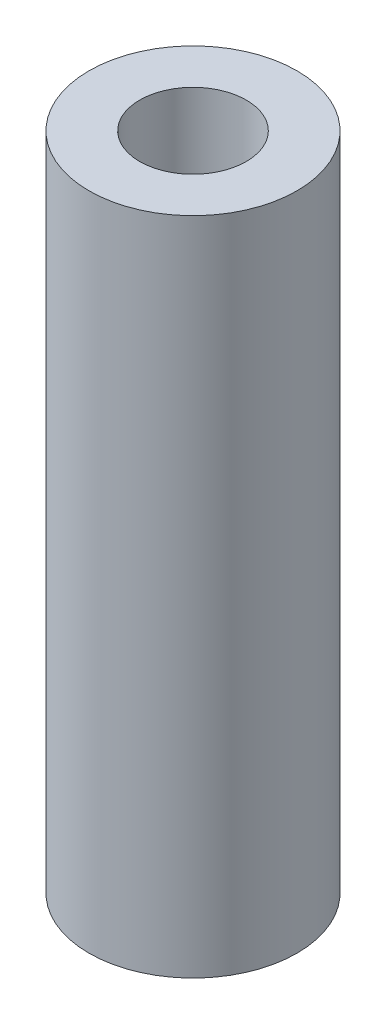
ISO-10303-21;
HEADER;
FILE_DESCRIPTION(('STEP AP214'),'2;1');
FILE_NAME('part.step','',(''),(''),'','','');
FILE_SCHEMA(('AUTOMOTIVE_DESIGN { 1 0 10303 214 1 1 1 1 }'));
ENDSEC;
DATA;
#1=APPLICATION_CONTEXT('core data for automotive mechanical design processes');
#2=APPLICATION_PROTOCOL_DEFINITION('international standard','automotive_design',2000,#1);
#3=PRODUCT_CONTEXT('',#1,'mechanical');
#4=PRODUCT('Part','Part','',(#3));
#5=PRODUCT_RELATED_PRODUCT_CATEGORY('part','',(#4));
#6=PRODUCT_DEFINITION_FORMATION('','',#4);
#7=PRODUCT_DEFINITION_CONTEXT('part definition',#1,'design');
#8=PRODUCT_DEFINITION('design','',#6,#7);
#9=PRODUCT_DEFINITION_SHAPE('','',#8);
#10=(LENGTH_UNIT() NAMED_UNIT(*) SI_UNIT(.MILLI.,.METRE.));
#11=(NAMED_UNIT(*) PLANE_ANGLE_UNIT() SI_UNIT($,.RADIAN.));
#12=(NAMED_UNIT(*) SI_UNIT($,.STERADIAN.) SOLID_ANGLE_UNIT());
#13=UNCERTAINTY_MEASURE_WITH_UNIT(LENGTH_MEASURE(1.E-05),#10,'distance_accuracy_value','');
#14=(GEOMETRIC_REPRESENTATION_CONTEXT(3) GLOBAL_UNCERTAINTY_ASSIGNED_CONTEXT((#13)) GLOBAL_UNIT_ASSIGNED_CONTEXT((#10,
#11,#12)) REPRESENTATION_CONTEXT('',''));
#15=CARTESIAN_POINT('',(0.,0.,0.));
#16=DIRECTION('',(0.,0.,1.));
#17=DIRECTION('',(1.,0.,0.));
#18=AXIS2_PLACEMENT_3D('',#15,#16,#17);
#19=CARTESIAN_POINT('',(0.,25.4,0.));
#20=DIRECTION('',(0.,-1.,0.));
#21=DIRECTION('',(0.,0.,-1.));
#22=AXIS2_PLACEMENT_3D('',#19,#20,#21);
#23=CYLINDRICAL_SURFACE('',#22,4.);
#24=CARTESIAN_POINT('',(0.,25.4,0.));
#25=DIRECTION('',(0.,1.,0.));
#26=DIRECTION('',(0.,0.,1.));
#27=AXIS2_PLACEMENT_3D('',#24,#25,#26);
#28=CIRCLE('',#27,4.);
#29=CARTESIAN_POINT('',(0.,25.4,4.));
#30=VERTEX_POINT('',#29);
#31=EDGE_CURVE('E10',#30,#30,#28,.T.);
#32=ORIENTED_EDGE('',*,*,#31,.F.);
#33=EDGE_LOOP('',(#32));
#34=FACE_BOUND('',#33,.T.);
#35=CARTESIAN_POINT('',(0.,0.,0.));
#36=DIRECTION('',(0.,1.,0.));
#37=DIRECTION('',(0.,0.,1.));
#38=AXIS2_PLACEMENT_3D('',#35,#36,#37);
#39=CIRCLE('',#38,4.);
#40=CARTESIAN_POINT('',(0.,0.,4.));
#41=VERTEX_POINT('',#40);
#42=EDGE_CURVE('E46',#41,#41,#39,.T.);
#43=ORIENTED_EDGE('',*,*,#42,.T.);
#44=EDGE_LOOP('',(#43));
#45=FACE_BOUND('',#44,.T.);
#46=ADVANCED_FACE('F43',(#34,#45),#23,.T.);
#47=CARTESIAN_POINT('',(0.,25.4,0.));
#48=DIRECTION('',(0.,1.,0.));
#49=DIRECTION('',(0.,0.,1.));
#50=AXIS2_PLACEMENT_3D('',#47,#48,#49);
#51=PLANE('',#50);
#52=CARTESIAN_POINT('',(0.,25.4,0.));
#53=DIRECTION('',(0.,1.,0.));
#54=DIRECTION('',(0.,0.,1.));
#55=AXIS2_PLACEMENT_3D('',#52,#53,#54);
#56=CIRCLE('',#55,2.05);
#57=CARTESIAN_POINT('',(0.,25.4,2.05));
#58=VERTEX_POINT('',#57);
#59=EDGE_CURVE('E57',#58,#58,#56,.T.);
#60=ORIENTED_EDGE('',*,*,#59,.F.);
#61=EDGE_LOOP('',(#60));
#62=FACE_BOUND('',#61,.T.);
#63=ORIENTED_EDGE('',*,*,#31,.T.);
#64=EDGE_LOOP('',(#63));
#65=FACE_BOUND('',#64,.T.);
#66=ADVANCED_FACE('F74',(#62,#65),#51,.T.);
#67=CARTESIAN_POINT('',(0.,0.,0.));
#68=DIRECTION('',(0.,1.,0.));
#69=DIRECTION('',(0.,0.,1.));
#70=AXIS2_PLACEMENT_3D('',#67,#68,#69);
#71=PLANE('',#70);
#72=CARTESIAN_POINT('',(0.,0.,0.));
#73=DIRECTION('',(0.,1.,0.));
#74=DIRECTION('',(0.,0.,1.));
#75=AXIS2_PLACEMENT_3D('',#72,#73,#74);
#76=CIRCLE('',#75,2.05);
#77=CARTESIAN_POINT('',(0.,0.,2.05));
#78=VERTEX_POINT('',#77);
#79=EDGE_CURVE('E55',#78,#78,#76,.T.);
#80=ORIENTED_EDGE('',*,*,#79,.T.);
#81=EDGE_LOOP('',(#80));
#82=FACE_BOUND('',#81,.T.);
#83=ORIENTED_EDGE('',*,*,#42,.F.);
#84=EDGE_LOOP('',(#83));
#85=FACE_BOUND('',#84,.T.);
#86=ADVANCED_FACE('F65',(#82,#85),#71,.F.);
#87=CARTESIAN_POINT('',(0.,0.,0.));
#88=DIRECTION('',(0.,1.,0.));
#89=DIRECTION('',(0.,0.,1.));
#90=AXIS2_PLACEMENT_3D('',#87,#88,#89);
#91=CYLINDRICAL_SURFACE('',#90,2.05);
#92=ORIENTED_EDGE('',*,*,#79,.F.);
#93=EDGE_LOOP('',(#92));
#94=FACE_BOUND('',#93,.T.);
#95=ORIENTED_EDGE('',*,*,#59,.T.);
#96=EDGE_LOOP('',(#95));
#97=FACE_BOUND('',#96,.T.);
#98=ADVANCED_FACE('F68',(#94,#97),#91,.F.);
#99=CLOSED_SHELL('',(#46,#66,#86,#98));
#100=MANIFOLD_SOLID_BREP('B2',#99);
#101=ADVANCED_BREP_SHAPE_REPRESENTATION('',(#18,#100),#14);
#102=SHAPE_DEFINITION_REPRESENTATION(#9,#101);
ENDSEC;
END-ISO-10303-21;
